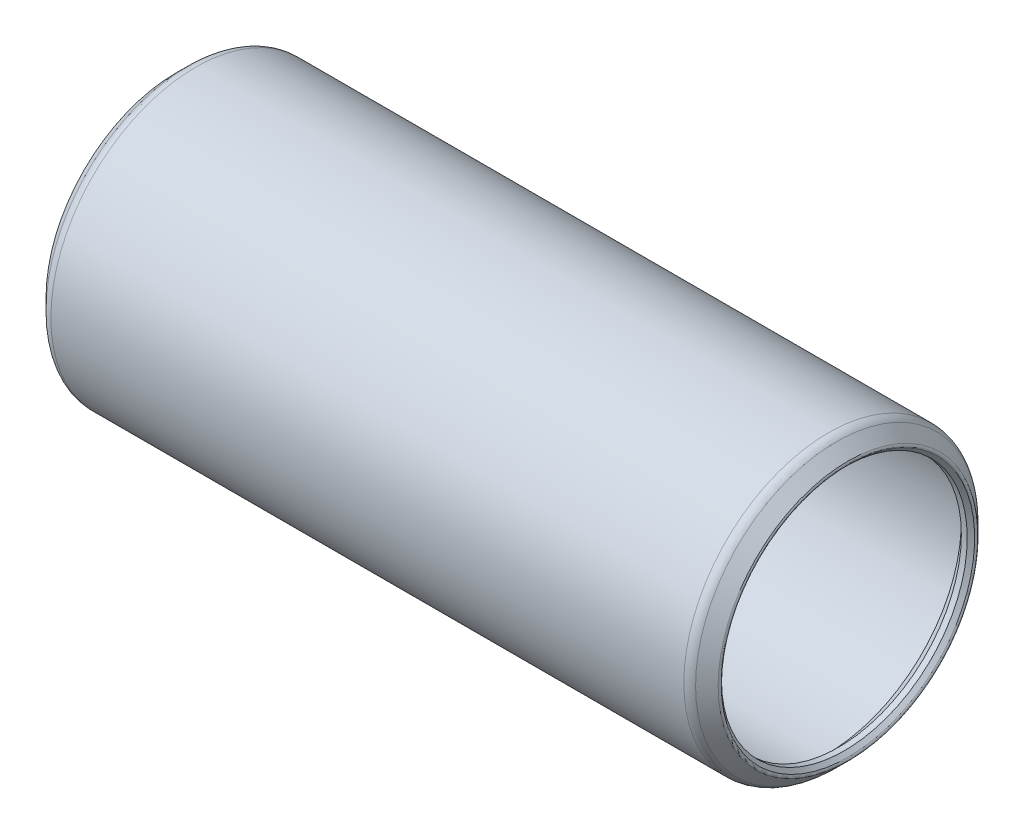
ISO-10303-21;
HEADER;
FILE_DESCRIPTION(('STEP AP214'),'2;1');
FILE_NAME('part.step','',(''),(''),'','','');
FILE_SCHEMA(('AUTOMOTIVE_DESIGN { 1 0 10303 214 1 1 1 1 }'));
ENDSEC;
DATA;
#1=APPLICATION_CONTEXT('core data for automotive mechanical design processes');
#2=APPLICATION_PROTOCOL_DEFINITION('international standard','automotive_design',2000,#1);
#3=PRODUCT_CONTEXT('',#1,'mechanical');
#4=PRODUCT('Part','Part','',(#3));
#5=PRODUCT_RELATED_PRODUCT_CATEGORY('part','',(#4));
#6=PRODUCT_DEFINITION_FORMATION('','',#4);
#7=PRODUCT_DEFINITION_CONTEXT('part definition',#1,'design');
#8=PRODUCT_DEFINITION('design','',#6,#7);
#9=PRODUCT_DEFINITION_SHAPE('','',#8);
#10=(LENGTH_UNIT() NAMED_UNIT(*) SI_UNIT(.MILLI.,.METRE.));
#11=(NAMED_UNIT(*) PLANE_ANGLE_UNIT() SI_UNIT($,.RADIAN.));
#12=(NAMED_UNIT(*) SI_UNIT($,.STERADIAN.) SOLID_ANGLE_UNIT());
#13=UNCERTAINTY_MEASURE_WITH_UNIT(LENGTH_MEASURE(1.E-05),#10,'distance_accuracy_value','');
#14=(GEOMETRIC_REPRESENTATION_CONTEXT(3) GLOBAL_UNCERTAINTY_ASSIGNED_CONTEXT((#13)) GLOBAL_UNIT_ASSIGNED_CONTEXT((#10,
#11,#12)) REPRESENTATION_CONTEXT('',''));
#15=CARTESIAN_POINT('',(0.,0.,0.));
#16=DIRECTION('',(0.,0.,1.));
#17=DIRECTION('',(1.,0.,0.));
#18=AXIS2_PLACEMENT_3D('',#15,#16,#17);
#19=CARTESIAN_POINT('',(-0.428157683632184,0.,0.));
#20=DIRECTION('',(-1.,0.,0.));
#21=DIRECTION('',(0.,0.,1.));
#22=AXIS2_PLACEMENT_3D('',#19,#20,#21);
#23=TOROIDAL_SURFACE('',#22,6.92601280605345,0.126999999999896);
#24=CARTESIAN_POINT('',(-0.517960244842769,0.,0.));
#25=DIRECTION('',(-1.,0.,0.));
#26=DIRECTION('',(0.,0.,1.));
#27=AXIS2_PLACEMENT_3D('',#24,#25,#26);
#28=CIRCLE('',#27,6.8362102448428);
#29=CARTESIAN_POINT('',(-0.517960244842769,0.,6.8362102448428));
#30=VERTEX_POINT('',#29);
#31=EDGE_CURVE('E10',#30,#30,#28,.T.);
#32=ORIENTED_EDGE('',*,*,#31,.F.);
#33=EDGE_LOOP('',(#32));
#34=FACE_BOUND('',#33,.T.);
#35=CARTESIAN_POINT('',(-0.517960244842769,0.,0.));
#36=DIRECTION('',(-1.,0.,0.));
#37=DIRECTION('',(0.,0.,1.));
#38=AXIS2_PLACEMENT_3D('',#35,#36,#37);
#39=CIRCLE('',#38,7.0158153672641);
#40=CARTESIAN_POINT('',(-0.517960244842769,0.,7.0158153672641));
#41=VERTEX_POINT('',#40);
#42=EDGE_CURVE('E78',#41,#41,#39,.T.);
#43=ORIENTED_EDGE('',*,*,#42,.T.);
#44=EDGE_LOOP('',(#43));
#45=FACE_BOUND('',#44,.T.);
#46=ADVANCED_FACE('F32',(#34,#45),#23,.T.);
#47=CARTESIAN_POINT('',(-0.517960244842769,0.,0.));
#48=DIRECTION('',(-1.,0.,0.));
#49=DIRECTION('',(0.,0.,1.));
#50=AXIS2_PLACEMENT_3D('',#47,#48,#49);
#51=CONICAL_SURFACE('',#50,6.8362102448428,0.785398163397522);
#52=CARTESIAN_POINT('',(-0.317499999999998,0.,0.));
#53=DIRECTION('',(-1.,0.,0.));
#54=DIRECTION('',(0.,0.,1.));
#55=AXIS2_PLACEMENT_3D('',#52,#53,#54);
#56=CIRCLE('',#55,6.63575);
#57=CARTESIAN_POINT('',(-0.317499999999998,0.,6.63575));
#58=VERTEX_POINT('',#57);
#59=EDGE_CURVE('E38',#58,#58,#56,.T.);
#60=ORIENTED_EDGE('',*,*,#59,.F.);
#61=EDGE_LOOP('',(#60));
#62=FACE_BOUND('',#61,.T.);
#63=ORIENTED_EDGE('',*,*,#31,.T.);
#64=EDGE_LOOP('',(#63));
#65=FACE_BOUND('',#64,.T.);
#66=ADVANCED_FACE('F151',(#62,#65),#51,.F.);
#67=CARTESIAN_POINT('',(35.2552,0.,0.));
#68=DIRECTION('',(-1.,0.,0.));
#69=DIRECTION('',(0.,0.,1.));
#70=AXIS2_PLACEMENT_3D('',#67,#68,#69);
#71=CYLINDRICAL_SURFACE('',#70,6.63575);
#72=CARTESIAN_POINT('',(0.,0.,0.));
#73=DIRECTION('',(-1.,0.,0.));
#74=DIRECTION('',(0.,0.,1.));
#75=AXIS2_PLACEMENT_3D('',#72,#73,#74);
#76=CIRCLE('',#75,6.63575);
#77=CARTESIAN_POINT('',(0.,0.,6.63575));
#78=VERTEX_POINT('',#77);
#79=EDGE_CURVE('E42',#78,#78,#76,.T.);
#80=ORIENTED_EDGE('',*,*,#79,.F.);
#81=EDGE_LOOP('',(#80));
#82=FACE_BOUND('',#81,.T.);
#83=ORIENTED_EDGE('',*,*,#59,.T.);
#84=EDGE_LOOP('',(#83));
#85=FACE_BOUND('',#84,.T.);
#86=ADVANCED_FACE('F146',(#82,#85),#71,.F.);
#87=CARTESIAN_POINT('',(0.,0.,0.));
#88=DIRECTION('',(1.,0.,0.));
#89=DIRECTION('',(0.,0.,-1.));
#90=AXIS2_PLACEMENT_3D('',#87,#88,#89);
#91=CONICAL_SURFACE('',#90,6.63575,0.78539816339745);
#92=CARTESIAN_POINT('',(0.634999999999997,0.,0.));
#93=DIRECTION('',(-1.,0.,0.));
#94=DIRECTION('',(0.,0.,1.));
#95=AXIS2_PLACEMENT_3D('',#92,#93,#94);
#96=CIRCLE('',#95,7.27075);
#97=CARTESIAN_POINT('',(0.634999999999997,0.,7.27075));
#98=VERTEX_POINT('',#97);
#99=EDGE_CURVE('E46',#98,#98,#96,.T.);
#100=ORIENTED_EDGE('',*,*,#99,.F.);
#101=EDGE_LOOP('',(#100));
#102=FACE_BOUND('',#101,.T.);
#103=ORIENTED_EDGE('',*,*,#79,.T.);
#104=EDGE_LOOP('',(#103));
#105=FACE_BOUND('',#104,.T.);
#106=ADVANCED_FACE('F140',(#102,#105),#91,.F.);
#107=CARTESIAN_POINT('',(35.2552,0.,0.));
#108=DIRECTION('',(-1.,0.,0.));
#109=DIRECTION('',(0.,0.,1.));
#110=AXIS2_PLACEMENT_3D('',#107,#108,#109);
#111=CYLINDRICAL_SURFACE('',#110,7.27075);
#112=CARTESIAN_POINT('',(34.6202,0.,0.));
#113=DIRECTION('',(-1.,0.,0.));
#114=DIRECTION('',(0.,0.,1.));
#115=AXIS2_PLACEMENT_3D('',#112,#113,#114);
#116=CIRCLE('',#115,7.27075);
#117=CARTESIAN_POINT('',(34.6202,0.,7.27075));
#118=VERTEX_POINT('',#117);
#119=EDGE_CURVE('E51',#118,#118,#116,.T.);
#120=ORIENTED_EDGE('',*,*,#119,.F.);
#121=EDGE_LOOP('',(#120));
#122=FACE_BOUND('',#121,.T.);
#123=ORIENTED_EDGE('',*,*,#99,.T.);
#124=EDGE_LOOP('',(#123));
#125=FACE_BOUND('',#124,.T.);
#126=ADVANCED_FACE('F134',(#122,#125),#111,.F.);
#127=CARTESIAN_POINT('',(34.6202,0.,0.));
#128=DIRECTION('',(-1.,0.,0.));
#129=DIRECTION('',(0.,0.,1.));
#130=AXIS2_PLACEMENT_3D('',#127,#128,#129);
#131=CONICAL_SURFACE('',#130,7.27075,0.785398163397445);
#132=CARTESIAN_POINT('',(35.2552,0.,0.));
#133=DIRECTION('',(-1.,0.,0.));
#134=DIRECTION('',(0.,0.,1.));
#135=AXIS2_PLACEMENT_3D('',#132,#133,#134);
#136=CIRCLE('',#135,6.63575);
#137=CARTESIAN_POINT('',(35.2552,0.,6.63575));
#138=VERTEX_POINT('',#137);
#139=EDGE_CURVE('E54',#138,#138,#136,.T.);
#140=ORIENTED_EDGE('',*,*,#139,.F.);
#141=EDGE_LOOP('',(#140));
#142=FACE_BOUND('',#141,.T.);
#143=ORIENTED_EDGE('',*,*,#119,.T.);
#144=EDGE_LOOP('',(#143));
#145=FACE_BOUND('',#144,.T.);
#146=ADVANCED_FACE('F128',(#142,#145),#131,.F.);
#147=CARTESIAN_POINT('',(35.2552,0.,0.));
#148=DIRECTION('',(-1.,0.,0.));
#149=DIRECTION('',(0.,0.,1.));
#150=AXIS2_PLACEMENT_3D('',#147,#148,#149);
#151=CYLINDRICAL_SURFACE('',#150,6.63575);
#152=CARTESIAN_POINT('',(35.5727,0.,0.));
#153=DIRECTION('',(-1.,0.,0.));
#154=DIRECTION('',(0.,0.,1.));
#155=AXIS2_PLACEMENT_3D('',#152,#153,#154);
#156=CIRCLE('',#155,6.63575);
#157=CARTESIAN_POINT('',(35.5727,0.,6.63575));
#158=VERTEX_POINT('',#157);
#159=EDGE_CURVE('E57',#158,#158,#156,.T.);
#160=ORIENTED_EDGE('',*,*,#159,.F.);
#161=EDGE_LOOP('',(#160));
#162=FACE_BOUND('',#161,.T.);
#163=ORIENTED_EDGE('',*,*,#139,.T.);
#164=EDGE_LOOP('',(#163));
#165=FACE_BOUND('',#164,.T.);
#166=ADVANCED_FACE('F122',(#162,#165),#151,.F.);
#167=CARTESIAN_POINT('',(35.5727,0.,0.));
#168=DIRECTION('',(1.,0.,0.));
#169=DIRECTION('',(0.,0.,-1.));
#170=AXIS2_PLACEMENT_3D('',#167,#168,#169);
#171=CONICAL_SURFACE('',#170,6.63575,0.785398163397446);
#172=CARTESIAN_POINT('',(35.773160244842,0.,0.));
#173=DIRECTION('',(-1.,0.,0.));
#174=DIRECTION('',(0.,0.,1.));
#175=AXIS2_PLACEMENT_3D('',#172,#173,#174);
#176=CIRCLE('',#175,6.83621024484204);
#177=CARTESIAN_POINT('',(35.773160244842,0.,6.83621024484204));
#178=VERTEX_POINT('',#177);
#179=EDGE_CURVE('E60',#178,#178,#176,.T.);
#180=ORIENTED_EDGE('',*,*,#179,.F.);
#181=EDGE_LOOP('',(#180));
#182=FACE_BOUND('',#181,.T.);
#183=ORIENTED_EDGE('',*,*,#159,.T.);
#184=EDGE_LOOP('',(#183));
#185=FACE_BOUND('',#184,.T.);
#186=ADVANCED_FACE('F116',(#182,#185),#171,.F.);
#187=CARTESIAN_POINT('',(35.6833576836309,0.,0.));
#188=DIRECTION('',(-1.,0.,0.));
#189=DIRECTION('',(0.,0.,1.));
#190=AXIS2_PLACEMENT_3D('',#187,#188,#189);
#191=TOROIDAL_SURFACE('',#190,6.92601280605323,0.127000000000639);
#192=CARTESIAN_POINT('',(35.773160244842,0.,0.));
#193=DIRECTION('',(-1.,0.,0.));
#194=DIRECTION('',(0.,0.,1.));
#195=AXIS2_PLACEMENT_3D('',#192,#193,#194);
#196=CIRCLE('',#195,7.01581536726443);
#197=CARTESIAN_POINT('',(35.773160244842,0.,7.01581536726443));
#198=VERTEX_POINT('',#197);
#199=EDGE_CURVE('E63',#198,#198,#196,.T.);
#200=ORIENTED_EDGE('',*,*,#199,.F.);
#201=EDGE_LOOP('',(#200));
#202=FACE_BOUND('',#201,.T.);
#203=ORIENTED_EDGE('',*,*,#179,.T.);
#204=EDGE_LOOP('',(#203));
#205=FACE_BOUND('',#204,.T.);
#206=ADVANCED_FACE('F110',(#202,#205),#191,.T.);
#207=CARTESIAN_POINT('',(35.773160244842,0.,0.));
#208=DIRECTION('',(-1.,0.,0.));
#209=DIRECTION('',(0.,0.,1.));
#210=AXIS2_PLACEMENT_3D('',#207,#208,#209);
#211=CONICAL_SURFACE('',#210,7.01581536726443,0.785398163397442);
#212=CARTESIAN_POINT('',(35.1644628060522,0.,0.));
#213=DIRECTION('',(-1.,0.,0.));
#214=DIRECTION('',(0.,0.,1.));
#215=AXIS2_PLACEMENT_3D('',#212,#213,#214);
#216=CIRCLE('',#215,7.6245128060543);
#217=CARTESIAN_POINT('',(35.1644628060522,0.,7.6245128060543));
#218=VERTEX_POINT('',#217);
#219=EDGE_CURVE('E66',#218,#218,#216,.T.);
#220=ORIENTED_EDGE('',*,*,#219,.F.);
#221=EDGE_LOOP('',(#220));
#222=FACE_BOUND('',#221,.T.);
#223=ORIENTED_EDGE('',*,*,#199,.T.);
#224=EDGE_LOOP('',(#223));
#225=FACE_BOUND('',#224,.T.);
#226=ADVANCED_FACE('F104',(#222,#225),#211,.T.);
#227=CARTESIAN_POINT('',(34.7154500000008,0.,0.));
#228=DIRECTION('',(-1.,0.,0.));
#229=DIRECTION('',(0.,0.,1.));
#230=AXIS2_PLACEMENT_3D('',#227,#228,#229);
#231=TOROIDAL_SURFACE('',#230,7.17550000000304,0.634999999996928);
#232=CARTESIAN_POINT('',(34.7154500000008,0.,0.));
#233=DIRECTION('',(-1.,0.,0.));
#234=DIRECTION('',(0.,0.,1.));
#235=AXIS2_PLACEMENT_3D('',#232,#233,#234);
#236=CIRCLE('',#235,7.81049999999996);
#237=CARTESIAN_POINT('',(34.7154500000008,0.,7.81049999999996));
#238=VERTEX_POINT('',#237);
#239=EDGE_CURVE('E69',#238,#238,#236,.T.);
#240=ORIENTED_EDGE('',*,*,#239,.F.);
#241=EDGE_LOOP('',(#240));
#242=FACE_BOUND('',#241,.T.);
#243=ORIENTED_EDGE('',*,*,#219,.T.);
#244=EDGE_LOOP('',(#243));
#245=FACE_BOUND('',#244,.T.);
#246=ADVANCED_FACE('F98',(#242,#245),#231,.T.);
#247=CARTESIAN_POINT('',(35.2552,0.,0.));
#248=DIRECTION('',(-1.,0.,0.));
#249=DIRECTION('',(0.,0.,1.));
#250=AXIS2_PLACEMENT_3D('',#247,#248,#249);
#251=CYLINDRICAL_SURFACE('',#250,7.81049999999998);
#252=CARTESIAN_POINT('',(0.539749999999999,0.,0.));
#253=DIRECTION('',(-1.,0.,0.));
#254=DIRECTION('',(0.,0.,1.));
#255=AXIS2_PLACEMENT_3D('',#252,#253,#254);
#256=CIRCLE('',#255,7.8105);
#257=CARTESIAN_POINT('',(0.539749999999999,0.,7.8105));
#258=VERTEX_POINT('',#257);
#259=EDGE_CURVE('E72',#258,#258,#256,.T.);
#260=ORIENTED_EDGE('',*,*,#259,.F.);
#261=EDGE_LOOP('',(#260));
#262=FACE_BOUND('',#261,.T.);
#263=ORIENTED_EDGE('',*,*,#239,.T.);
#264=EDGE_LOOP('',(#263));
#265=FACE_BOUND('',#264,.T.);
#266=ADVANCED_FACE('F92',(#262,#265),#251,.T.);
#267=CARTESIAN_POINT('',(0.539749999999892,0.,0.));
#268=DIRECTION('',(-1.,0.,0.));
#269=DIRECTION('',(0.,0.,1.));
#270=AXIS2_PLACEMENT_3D('',#267,#268,#269);
#271=TOROIDAL_SURFACE('',#270,7.17550000000016,0.634999999999845);
#272=CARTESIAN_POINT('',(0.0907371939465398,0.,0.));
#273=DIRECTION('',(-1.,0.,0.));
#274=DIRECTION('',(0.,0.,1.));
#275=AXIS2_PLACEMENT_3D('',#272,#273,#274);
#276=CIRCLE('',#275,7.6245128060535);
#277=CARTESIAN_POINT('',(0.0907371939465398,0.,7.6245128060535));
#278=VERTEX_POINT('',#277);
#279=EDGE_CURVE('E75',#278,#278,#276,.T.);
#280=ORIENTED_EDGE('',*,*,#279,.F.);
#281=EDGE_LOOP('',(#280));
#282=FACE_BOUND('',#281,.T.);
#283=ORIENTED_EDGE('',*,*,#259,.T.);
#284=EDGE_LOOP('',(#283));
#285=FACE_BOUND('',#284,.T.);
#286=ADVANCED_FACE('F86',(#282,#285),#271,.T.);
#287=CARTESIAN_POINT('',(0.0907371939465398,0.,0.));
#288=DIRECTION('',(1.,0.,0.));
#289=DIRECTION('',(0.,0.,-1.));
#290=AXIS2_PLACEMENT_3D('',#287,#288,#289);
#291=CONICAL_SURFACE('',#290,7.6245128060535,0.785398163397523);
#292=ORIENTED_EDGE('',*,*,#42,.F.);
#293=EDGE_LOOP('',(#292));
#294=FACE_BOUND('',#293,.T.);
#295=ORIENTED_EDGE('',*,*,#279,.T.);
#296=EDGE_LOOP('',(#295));
#297=FACE_BOUND('',#296,.T.);
#298=ADVANCED_FACE('F83',(#294,#297),#291,.T.);
#299=CLOSED_SHELL('',(#46,#66,#86,#106,#126,#146,#166,#186,#206,#226,#246,#266,#286,#298));
#300=MANIFOLD_SOLID_BREP('B2',#299);
#301=ADVANCED_BREP_SHAPE_REPRESENTATION('',(#18,#300),#14);
#302=SHAPE_DEFINITION_REPRESENTATION(#9,#301);
ENDSEC;
END-ISO-10303-21;
